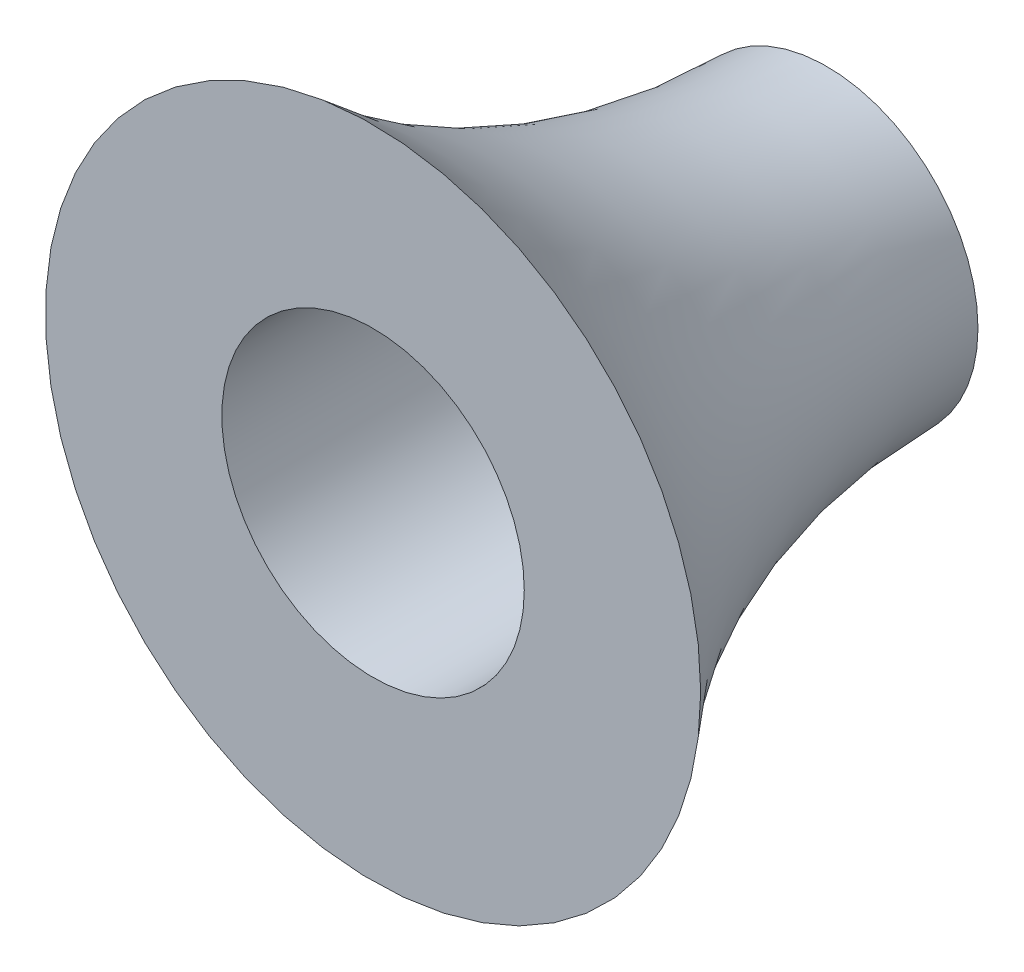
ISO-10303-21;
HEADER;
FILE_DESCRIPTION(('STEP AP214'),'2;1');
FILE_NAME('part.step','',(''),(''),'','','');
FILE_SCHEMA(('AUTOMOTIVE_DESIGN { 1 0 10303 214 1 1 1 1 }'));
ENDSEC;
DATA;
#1=APPLICATION_CONTEXT('core data for automotive mechanical design processes');
#2=APPLICATION_PROTOCOL_DEFINITION('international standard','automotive_design',2000,#1);
#3=PRODUCT_CONTEXT('',#1,'mechanical');
#4=PRODUCT('Part','Part','',(#3));
#5=PRODUCT_RELATED_PRODUCT_CATEGORY('part','',(#4));
#6=PRODUCT_DEFINITION_FORMATION('','',#4);
#7=PRODUCT_DEFINITION_CONTEXT('part definition',#1,'design');
#8=PRODUCT_DEFINITION('design','',#6,#7);
#9=PRODUCT_DEFINITION_SHAPE('','',#8);
#10=(LENGTH_UNIT() NAMED_UNIT(*) SI_UNIT(.MILLI.,.METRE.));
#11=(NAMED_UNIT(*) PLANE_ANGLE_UNIT() SI_UNIT($,.RADIAN.));
#12=(NAMED_UNIT(*) SI_UNIT($,.STERADIAN.) SOLID_ANGLE_UNIT());
#13=UNCERTAINTY_MEASURE_WITH_UNIT(LENGTH_MEASURE(1.E-05),#10,'distance_accuracy_value','');
#14=(GEOMETRIC_REPRESENTATION_CONTEXT(3) GLOBAL_UNCERTAINTY_ASSIGNED_CONTEXT((#13)) GLOBAL_UNIT_ASSIGNED_CONTEXT((#10,
#11,#12)) REPRESENTATION_CONTEXT('',''));
#15=CARTESIAN_POINT('',(0.,0.,0.));
#16=DIRECTION('',(0.,0.,1.));
#17=DIRECTION('',(1.,0.,0.));
#18=AXIS2_PLACEMENT_3D('',#15,#16,#17);
#19=CARTESIAN_POINT('',(2.79194473467972,3.31694473467972,-7.02));
#20=DIRECTION('',(0.,0.,1.));
#21=DIRECTION('',(1.,0.,0.));
#22=AXIS2_PLACEMENT_3D('',#19,#20,#21);
#23=PLANE('',#22);
#24=CARTESIAN_POINT('',(3.675,4.2,-7.02));
#25=DIRECTION('',(0.,0.,1.));
#26=DIRECTION('',(1.,0.,0.));
#27=AXIS2_PLACEMENT_3D('',#24,#25,#26);
#28=CIRCLE('',#27,0.299999999999999);
#29=CARTESIAN_POINT('',(3.975,4.2,-7.02));
#30=VERTEX_POINT('',#29);
#31=EDGE_CURVE('E19',#30,#30,#28,.T.);
#32=ORIENTED_EDGE('',*,*,#31,.F.);
#33=EDGE_LOOP('',(#32));
#34=FACE_BOUND('',#33,.T.);
#35=CARTESIAN_POINT('',(3.675,4.2,-7.01999999999981));
#36=DIRECTION('',(0.,0.,1.));
#37=DIRECTION('',(1.,0.,0.));
#38=AXIS2_PLACEMENT_3D('',#35,#36,#37);
#39=CIRCLE('',#38,0.650000000001198);
#40=CARTESIAN_POINT('',(4.3250000000012,4.2,-7.01999999999981));
#41=VERTEX_POINT('',#40);
#42=EDGE_CURVE('E23',#41,#41,#39,.F.);
#43=ORIENTED_EDGE('',*,*,#42,.F.);
#44=EDGE_LOOP('',(#43));
#45=FACE_BOUND('',#44,.T.);
#46=ADVANCED_FACE('F15',(#34,#45),#23,.T.);
#47=CARTESIAN_POINT('',(3.675,4.2,-7.92));
#48=DIRECTION('',(0.,0.,1.));
#49=DIRECTION('',(1.,0.,0.));
#50=AXIS2_PLACEMENT_3D('',#47,#48,#49);
#51=CYLINDRICAL_SURFACE('',#50,0.299999999999999);
#52=ORIENTED_EDGE('',*,*,#31,.T.);
#53=EDGE_LOOP('',(#52));
#54=FACE_BOUND('',#53,.T.);
#55=CARTESIAN_POINT('',(3.675,4.2,-7.92));
#56=DIRECTION('',(0.,0.,1.));
#57=DIRECTION('',(1.,0.,0.));
#58=AXIS2_PLACEMENT_3D('',#55,#56,#57);
#59=CIRCLE('',#58,0.299999999999999);
#60=CARTESIAN_POINT('',(3.975,4.2,-7.92));
#61=VERTEX_POINT('',#60);
#62=EDGE_CURVE('E10',#61,#61,#59,.T.);
#63=ORIENTED_EDGE('',*,*,#62,.F.);
#64=EDGE_LOOP('',(#63));
#65=FACE_BOUND('',#64,.T.);
#66=ADVANCED_FACE('F33',(#54,#65),#51,.F.);
#67=CARTESIAN_POINT('',(3.675,4.2,-7.92));
#68=DIRECTION('',(0.,0.,1.));
#69=DIRECTION('',(1.,0.,0.));
#70=AXIS2_PLACEMENT_3D('',#67,#68,#69);
#71=TOROIDAL_SURFACE('',#70,1.63214285713999,1.33214285713999);
#72=ORIENTED_EDGE('',*,*,#62,.T.);
#73=EDGE_LOOP('',(#72));
#74=FACE_BOUND('',#73,.T.);
#75=ORIENTED_EDGE('',*,*,#42,.T.);
#76=EDGE_LOOP('',(#75));
#77=FACE_BOUND('',#76,.T.);
#78=ADVANCED_FACE('F17',(#74,#77),#71,.F.);
#79=CLOSED_SHELL('',(#46,#66,#78));
#80=MANIFOLD_SOLID_BREP('B1',#79);
#81=ADVANCED_BREP_SHAPE_REPRESENTATION('',(#18,#80),#14);
#82=SHAPE_DEFINITION_REPRESENTATION(#9,#81);
ENDSEC;
END-ISO-10303-21;
